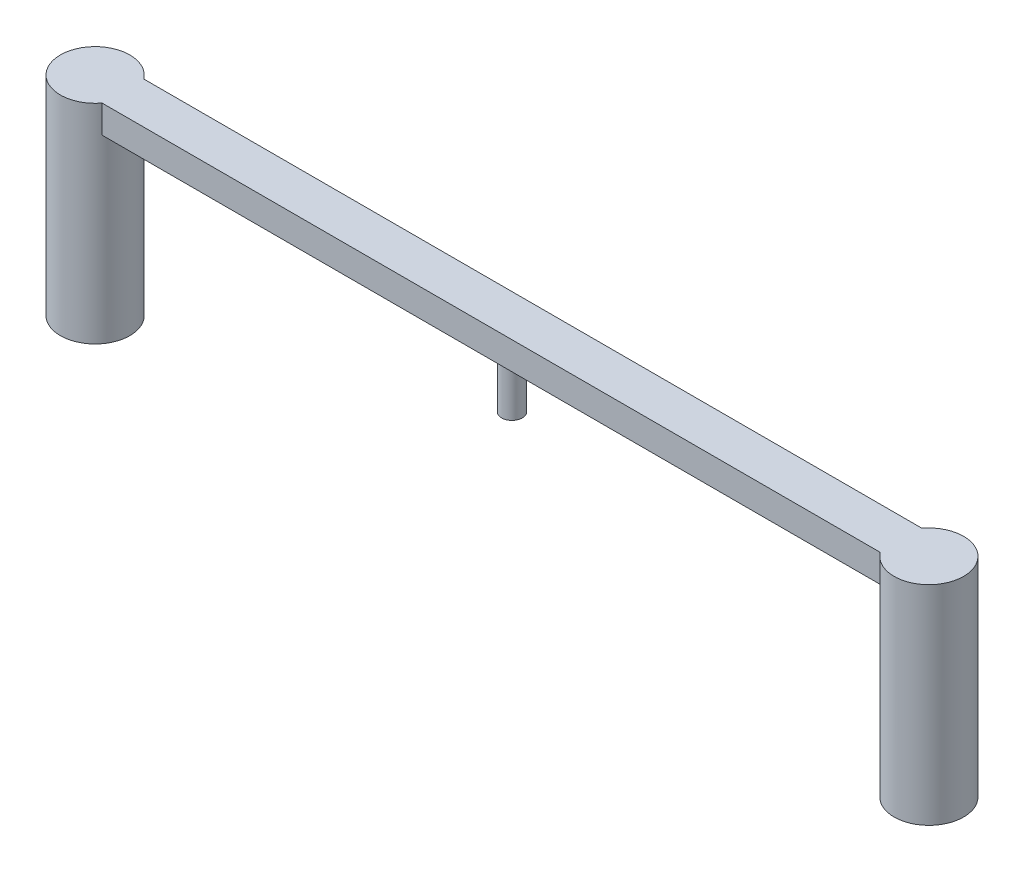
ISO-10303-21;
HEADER;
FILE_DESCRIPTION(('STEP AP214'),'2;1');
FILE_NAME('part.step','',(''),(''),'','','');
FILE_SCHEMA(('AUTOMOTIVE_DESIGN { 1 0 10303 214 1 1 1 1 }'));
ENDSEC;
DATA;
#1=APPLICATION_CONTEXT('core data for automotive mechanical design processes');
#2=APPLICATION_PROTOCOL_DEFINITION('international standard','automotive_design',2000,#1);
#3=PRODUCT_CONTEXT('',#1,'mechanical');
#4=PRODUCT('Part','Part','',(#3));
#5=PRODUCT_RELATED_PRODUCT_CATEGORY('part','',(#4));
#6=PRODUCT_DEFINITION_FORMATION('','',#4);
#7=PRODUCT_DEFINITION_CONTEXT('part definition',#1,'design');
#8=PRODUCT_DEFINITION('design','',#6,#7);
#9=PRODUCT_DEFINITION_SHAPE('','',#8);
#10=(LENGTH_UNIT() NAMED_UNIT(*) SI_UNIT(.MILLI.,.METRE.));
#11=(NAMED_UNIT(*) PLANE_ANGLE_UNIT() SI_UNIT($,.RADIAN.));
#12=(NAMED_UNIT(*) SI_UNIT($,.STERADIAN.) SOLID_ANGLE_UNIT());
#13=UNCERTAINTY_MEASURE_WITH_UNIT(LENGTH_MEASURE(1.E-05),#10,'distance_accuracy_value','');
#14=(GEOMETRIC_REPRESENTATION_CONTEXT(3) GLOBAL_UNCERTAINTY_ASSIGNED_CONTEXT((#13)) GLOBAL_UNIT_ASSIGNED_CONTEXT((#10,
#11,#12)) REPRESENTATION_CONTEXT('',''));
#15=CARTESIAN_POINT('',(0.,0.,0.));
#16=DIRECTION('',(0.,0.,1.));
#17=DIRECTION('',(1.,0.,0.));
#18=AXIS2_PLACEMENT_3D('',#15,#16,#17);
#19=CARTESIAN_POINT('',(-30.,-2.,1.5));
#20=DIRECTION('',(0.,0.,-1.));
#21=DIRECTION('',(0.,1.,0.));
#22=AXIS2_PLACEMENT_3D('',#19,#20,#21);
#23=PLANE('',#22);
#24=DIRECTION('',(-1.,0.,0.));
#25=VECTOR('',#24,1.);
#26=CARTESIAN_POINT('',(-30.,-2.,1.5));
#27=LINE('',#26,#25);
#28=CARTESIAN_POINT('',(28.,-2.,1.5));
#29=VERTEX_POINT('',#28);
#30=CARTESIAN_POINT('',(-28.,-2.,1.5));
#31=VERTEX_POINT('',#30);
#32=EDGE_CURVE('E11',#29,#31,#27,.T.);
#33=ORIENTED_EDGE('',*,*,#32,.F.);
#34=DIRECTION('',(0.,1.,0.));
#35=VECTOR('',#34,1.);
#36=CARTESIAN_POINT('',(28.,-15.,1.5));
#37=LINE('',#36,#35);
#38=CARTESIAN_POINT('',(28.,0.,1.5));
#39=VERTEX_POINT('',#38);
#40=EDGE_CURVE('E25',#29,#39,#37,.T.);
#41=ORIENTED_EDGE('',*,*,#40,.T.);
#42=DIRECTION('',(-1.,0.,0.));
#43=VECTOR('',#42,1.);
#44=CARTESIAN_POINT('',(-30.,0.,1.5));
#45=LINE('',#44,#43);
#46=CARTESIAN_POINT('',(-28.,0.,1.5));
#47=VERTEX_POINT('',#46);
#48=EDGE_CURVE('E120',#39,#47,#45,.T.);
#49=ORIENTED_EDGE('',*,*,#48,.T.);
#50=DIRECTION('',(0.,1.,0.));
#51=VECTOR('',#50,1.);
#52=CARTESIAN_POINT('',(-28.,-15.,1.5));
#53=LINE('',#52,#51);
#54=EDGE_CURVE('E88',#47,#31,#53,.F.);
#55=ORIENTED_EDGE('',*,*,#54,.T.);
#56=EDGE_LOOP('',(#33,#41,#49,#55));
#57=FACE_BOUND('',#56,.T.);
#58=ADVANCED_FACE('F17',(#57),#23,.F.);
#59=CARTESIAN_POINT('',(-30.,-2.,-1.5));
#60=DIRECTION('',(0.,0.,1.));
#61=DIRECTION('',(0.,-1.,0.));
#62=AXIS2_PLACEMENT_3D('',#59,#60,#61);
#63=PLANE('',#62);
#64=DIRECTION('',(1.,0.,0.));
#65=VECTOR('',#64,1.);
#66=CARTESIAN_POINT('',(-30.,0.,-1.5));
#67=LINE('',#66,#65);
#68=CARTESIAN_POINT('',(-28.,0.,-1.5));
#69=VERTEX_POINT('',#68);
#70=CARTESIAN_POINT('',(28.,0.,-1.5));
#71=VERTEX_POINT('',#70);
#72=EDGE_CURVE('E68',#69,#71,#67,.T.);
#73=ORIENTED_EDGE('',*,*,#72,.T.);
#74=DIRECTION('',(0.,1.,0.));
#75=VECTOR('',#74,1.);
#76=CARTESIAN_POINT('',(28.,-15.,-1.5));
#77=LINE('',#76,#75);
#78=CARTESIAN_POINT('',(28.,-2.,-1.5));
#79=VERTEX_POINT('',#78);
#80=EDGE_CURVE('E89',#71,#79,#77,.F.);
#81=ORIENTED_EDGE('',*,*,#80,.T.);
#82=DIRECTION('',(1.,0.,0.));
#83=VECTOR('',#82,1.);
#84=CARTESIAN_POINT('',(-30.,-2.,-1.5));
#85=LINE('',#84,#83);
#86=CARTESIAN_POINT('',(-28.,-2.,-1.5));
#87=VERTEX_POINT('',#86);
#88=EDGE_CURVE('E71',#87,#79,#85,.T.);
#89=ORIENTED_EDGE('',*,*,#88,.F.);
#90=DIRECTION('',(0.,1.,0.));
#91=VECTOR('',#90,1.);
#92=CARTESIAN_POINT('',(-28.,-15.,-1.5));
#93=LINE('',#92,#91);
#94=EDGE_CURVE('E65',#87,#69,#93,.T.);
#95=ORIENTED_EDGE('',*,*,#94,.T.);
#96=EDGE_LOOP('',(#73,#81,#89,#95));
#97=FACE_BOUND('',#96,.T.);
#98=ADVANCED_FACE('F67',(#97),#63,.F.);
#99=CARTESIAN_POINT('',(0.,-2.,0.));
#100=DIRECTION('',(0.,-1.,0.));
#101=DIRECTION('',(1.,0.,0.));
#102=AXIS2_PLACEMENT_3D('',#99,#100,#101);
#103=PLANE('',#102);
#104=CARTESIAN_POINT('',(0.,-2.,0.));
#105=DIRECTION('',(0.,-1.,0.));
#106=DIRECTION('',(1.,0.,0.));
#107=AXIS2_PLACEMENT_3D('',#104,#105,#106);
#108=CIRCLE('',#107,0.75);
#109=CARTESIAN_POINT('',(0.75,-2.,0.));
#110=VERTEX_POINT('',#109);
#111=EDGE_CURVE('E77',#110,#110,#108,.T.);
#112=ORIENTED_EDGE('',*,*,#111,.F.);
#113=EDGE_LOOP('',(#112));
#114=FACE_BOUND('',#113,.T.);
#115=CARTESIAN_POINT('',(30.,-2.,0.));
#116=DIRECTION('',(0.,-1.,0.));
#117=DIRECTION('',(1.,0.,0.));
#118=AXIS2_PLACEMENT_3D('',#115,#116,#117);
#119=CIRCLE('',#118,2.5);
#120=EDGE_CURVE('E107',#29,#79,#119,.T.);
#121=ORIENTED_EDGE('',*,*,#120,.F.);
#122=ORIENTED_EDGE('',*,*,#32,.T.);
#123=CARTESIAN_POINT('',(-30.,-2.,0.));
#124=DIRECTION('',(0.,-1.,0.));
#125=DIRECTION('',(1.,0.,0.));
#126=AXIS2_PLACEMENT_3D('',#123,#124,#125);
#127=CIRCLE('',#126,2.5);
#128=EDGE_CURVE('E98',#87,#31,#127,.T.);
#129=ORIENTED_EDGE('',*,*,#128,.F.);
#130=ORIENTED_EDGE('',*,*,#88,.T.);
#131=EDGE_LOOP('',(#121,#122,#129,#130));
#132=FACE_BOUND('',#131,.T.);
#133=ADVANCED_FACE('F140',(#114,#132),#103,.T.);
#134=CARTESIAN_POINT('',(0.,0.,0.));
#135=DIRECTION('',(0.,-1.,0.));
#136=DIRECTION('',(1.,0.,0.));
#137=AXIS2_PLACEMENT_3D('',#134,#135,#136);
#138=PLANE('',#137);
#139=ORIENTED_EDGE('',*,*,#48,.F.);
#140=CARTESIAN_POINT('',(30.,0.,0.));
#141=DIRECTION('',(0.,1.,0.));
#142=DIRECTION('',(-1.,0.,0.));
#143=AXIS2_PLACEMENT_3D('',#140,#141,#142);
#144=CIRCLE('',#143,2.5);
#145=EDGE_CURVE('E85',#39,#71,#144,.T.);
#146=ORIENTED_EDGE('',*,*,#145,.T.);
#147=ORIENTED_EDGE('',*,*,#72,.F.);
#148=CARTESIAN_POINT('',(-30.,0.,0.));
#149=DIRECTION('',(0.,1.,0.));
#150=DIRECTION('',(-1.,0.,0.));
#151=AXIS2_PLACEMENT_3D('',#148,#149,#150);
#152=CIRCLE('',#151,2.5);
#153=EDGE_CURVE('E82',#69,#47,#152,.T.);
#154=ORIENTED_EDGE('',*,*,#153,.T.);
#155=EDGE_LOOP('',(#139,#146,#147,#154));
#156=FACE_BOUND('',#155,.T.);
#157=ADVANCED_FACE('F81',(#156),#138,.F.);
#158=CARTESIAN_POINT('',(-30.,-15.,0.));
#159=DIRECTION('',(0.,1.,0.));
#160=DIRECTION('',(-1.,0.,0.));
#161=AXIS2_PLACEMENT_3D('',#158,#159,#160);
#162=CYLINDRICAL_SURFACE('',#161,2.5);
#163=CARTESIAN_POINT('',(-30.,-15.,0.));
#164=DIRECTION('',(0.,1.,0.));
#165=DIRECTION('',(-1.,0.,0.));
#166=AXIS2_PLACEMENT_3D('',#163,#164,#165);
#167=CIRCLE('',#166,2.5);
#168=CARTESIAN_POINT('',(-32.5,-15.,0.));
#169=VERTEX_POINT('',#168);
#170=EDGE_CURVE('E93',#169,#169,#167,.T.);
#171=ORIENTED_EDGE('',*,*,#170,.T.);
#172=EDGE_LOOP('',(#171));
#173=FACE_BOUND('',#172,.T.);
#174=ORIENTED_EDGE('',*,*,#54,.F.);
#175=ORIENTED_EDGE('',*,*,#153,.F.);
#176=ORIENTED_EDGE('',*,*,#94,.F.);
#177=ORIENTED_EDGE('',*,*,#128,.T.);
#178=EDGE_LOOP('',(#174,#175,#176,#177));
#179=FACE_BOUND('',#178,.T.);
#180=ADVANCED_FACE('F91',(#173,#179),#162,.T.);
#181=CARTESIAN_POINT('',(-30.,-15.,0.));
#182=DIRECTION('',(0.,1.,0.));
#183=DIRECTION('',(-1.,0.,0.));
#184=AXIS2_PLACEMENT_3D('',#181,#182,#183);
#185=PLANE('',#184);
#186=ORIENTED_EDGE('',*,*,#170,.F.);
#187=EDGE_LOOP('',(#186));
#188=FACE_BOUND('',#187,.T.);
#189=ADVANCED_FACE('F185',(#188),#185,.F.);
#190=CARTESIAN_POINT('',(30.,-15.,0.));
#191=DIRECTION('',(0.,1.,0.));
#192=DIRECTION('',(-1.,0.,0.));
#193=AXIS2_PLACEMENT_3D('',#190,#191,#192);
#194=CYLINDRICAL_SURFACE('',#193,2.5);
#195=CARTESIAN_POINT('',(30.,-15.,0.));
#196=DIRECTION('',(0.,1.,0.));
#197=DIRECTION('',(-1.,0.,0.));
#198=AXIS2_PLACEMENT_3D('',#195,#196,#197);
#199=CIRCLE('',#198,2.5);
#200=CARTESIAN_POINT('',(27.5,-15.,0.));
#201=VERTEX_POINT('',#200);
#202=EDGE_CURVE('E101',#201,#201,#199,.T.);
#203=ORIENTED_EDGE('',*,*,#202,.T.);
#204=EDGE_LOOP('',(#203));
#205=FACE_BOUND('',#204,.T.);
#206=ORIENTED_EDGE('',*,*,#40,.F.);
#207=ORIENTED_EDGE('',*,*,#120,.T.);
#208=ORIENTED_EDGE('',*,*,#80,.F.);
#209=ORIENTED_EDGE('',*,*,#145,.F.);
#210=EDGE_LOOP('',(#206,#207,#208,#209));
#211=FACE_BOUND('',#210,.T.);
#212=ADVANCED_FACE('F138',(#205,#211),#194,.T.);
#213=CARTESIAN_POINT('',(30.,-15.,0.));
#214=DIRECTION('',(0.,1.,0.));
#215=DIRECTION('',(-1.,0.,0.));
#216=AXIS2_PLACEMENT_3D('',#213,#214,#215);
#217=PLANE('',#216);
#218=ORIENTED_EDGE('',*,*,#202,.F.);
#219=EDGE_LOOP('',(#218));
#220=FACE_BOUND('',#219,.T.);
#221=ADVANCED_FACE('F206',(#220),#217,.F.);
#222=CARTESIAN_POINT('',(0.,-6.,0.));
#223=DIRECTION('',(0.,1.,0.));
#224=DIRECTION('',(-1.,0.,0.));
#225=AXIS2_PLACEMENT_3D('',#222,#223,#224);
#226=CYLINDRICAL_SURFACE('',#225,0.750000000000083);
#227=ORIENTED_EDGE('',*,*,#111,.T.);
#228=EDGE_LOOP('',(#227));
#229=FACE_BOUND('',#228,.T.);
#230=CARTESIAN_POINT('',(0.,-6.,0.));
#231=DIRECTION('',(0.,1.,0.));
#232=DIRECTION('',(-1.,0.,0.));
#233=AXIS2_PLACEMENT_3D('',#230,#231,#232);
#234=CIRCLE('',#233,0.750000000000083);
#235=CARTESIAN_POINT('',(-0.750000000000068,-6.,0.));
#236=VERTEX_POINT('',#235);
#237=EDGE_CURVE('E306',#236,#236,#234,.T.);
#238=ORIENTED_EDGE('',*,*,#237,.T.);
#239=EDGE_LOOP('',(#238));
#240=FACE_BOUND('',#239,.T.);
#241=ADVANCED_FACE('F217',(#229,#240),#226,.T.);
#242=CARTESIAN_POINT('',(0.,-6.,0.));
#243=DIRECTION('',(0.,1.,0.));
#244=DIRECTION('',(-1.,0.,0.));
#245=AXIS2_PLACEMENT_3D('',#242,#243,#244);
#246=PLANE('',#245);
#247=ORIENTED_EDGE('',*,*,#237,.F.);
#248=EDGE_LOOP('',(#247));
#249=FACE_BOUND('',#248,.T.);
#250=ADVANCED_FACE('F228',(#249),#246,.F.);
#251=CLOSED_SHELL('',(#58,#98,#133,#157,#180,#189,#212,#221,#241,#250));
#252=MANIFOLD_SOLID_BREP('B1',#251);
#253=ADVANCED_BREP_SHAPE_REPRESENTATION('',(#18,#252),#14);
#254=SHAPE_DEFINITION_REPRESENTATION(#9,#253);
ENDSEC;
END-ISO-10303-21;
